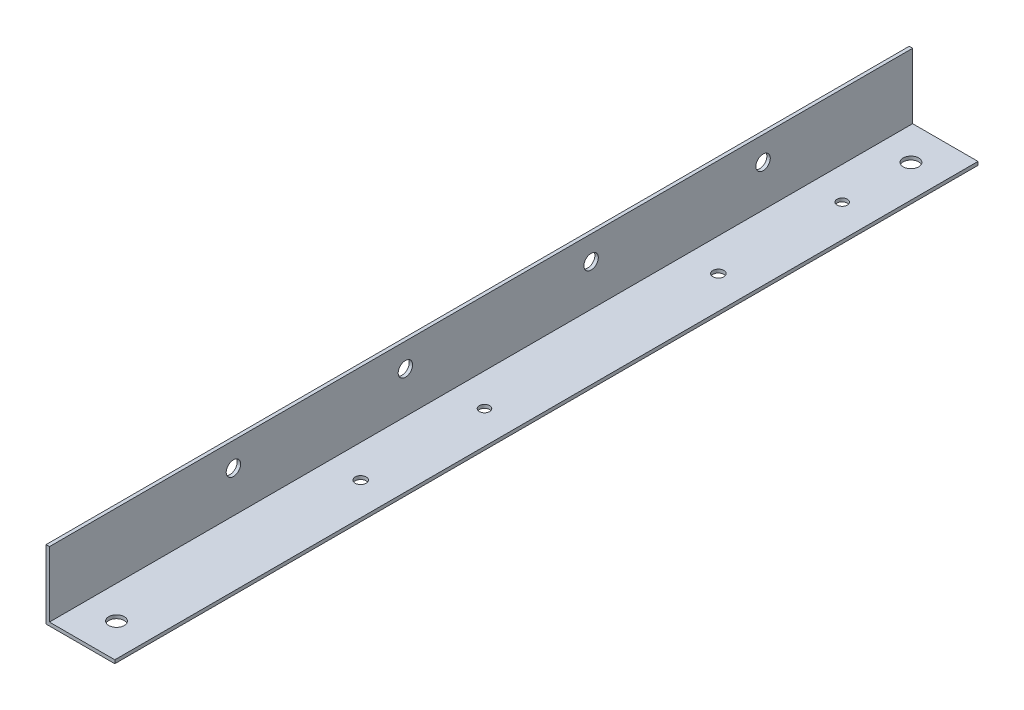
ISO-10303-21;
HEADER;
FILE_DESCRIPTION(('STEP AP214'),'2;1');
FILE_NAME('part.step','',(''),(''),'','','');
FILE_SCHEMA(('AUTOMOTIVE_DESIGN { 1 0 10303 214 1 1 1 1 }'));
ENDSEC;
DATA;
#1=APPLICATION_CONTEXT('core data for automotive mechanical design processes');
#2=APPLICATION_PROTOCOL_DEFINITION('international standard','automotive_design',2000,#1);
#3=PRODUCT_CONTEXT('',#1,'mechanical');
#4=PRODUCT('Part','Part','',(#3));
#5=PRODUCT_RELATED_PRODUCT_CATEGORY('part','',(#4));
#6=PRODUCT_DEFINITION_FORMATION('','',#4);
#7=PRODUCT_DEFINITION_CONTEXT('part definition',#1,'design');
#8=PRODUCT_DEFINITION('design','',#6,#7);
#9=PRODUCT_DEFINITION_SHAPE('','',#8);
#10=(LENGTH_UNIT() NAMED_UNIT(*) SI_UNIT(.MILLI.,.METRE.));
#11=(NAMED_UNIT(*) PLANE_ANGLE_UNIT() SI_UNIT($,.RADIAN.));
#12=(NAMED_UNIT(*) SI_UNIT($,.STERADIAN.) SOLID_ANGLE_UNIT());
#13=UNCERTAINTY_MEASURE_WITH_UNIT(LENGTH_MEASURE(1.E-05),#10,'distance_accuracy_value','');
#14=(GEOMETRIC_REPRESENTATION_CONTEXT(3) GLOBAL_UNCERTAINTY_ASSIGNED_CONTEXT((#13)) GLOBAL_UNIT_ASSIGNED_CONTEXT((#10,
#11,#12)) REPRESENTATION_CONTEXT('',''));
#15=CARTESIAN_POINT('',(0.,0.,0.));
#16=DIRECTION('',(0.,0.,1.));
#17=DIRECTION('',(1.,0.,0.));
#18=AXIS2_PLACEMENT_3D('',#15,#16,#17);
#19=CARTESIAN_POINT('',(20.,0.,251.));
#20=DIRECTION('',(0.,1.,0.));
#21=DIRECTION('',(-1.,0.,0.));
#22=AXIS2_PLACEMENT_3D('',#19,#20,#21);
#23=PLANE('',#22);
#24=CARTESIAN_POINT('',(10.5,0.,241.));
#25=DIRECTION('',(0.,1.,0.));
#26=DIRECTION('',(0.,0.,1.));
#27=AXIS2_PLACEMENT_3D('',#24,#25,#26);
#28=CIRCLE('',#27,2.25);
#29=CARTESIAN_POINT('',(10.5,0.,243.25));
#30=VERTEX_POINT('',#29);
#31=EDGE_CURVE('E171',#30,#30,#28,.T.);
#32=ORIENTED_EDGE('',*,*,#31,.T.);
#33=EDGE_LOOP('',(#32));
#34=FACE_BOUND('',#33,.T.);
#35=CARTESIAN_POINT('',(10.5,0.,10.));
#36=DIRECTION('',(0.,1.,0.));
#37=DIRECTION('',(0.,0.,1.));
#38=AXIS2_PLACEMENT_3D('',#35,#36,#37);
#39=CIRCLE('',#38,2.25);
#40=CARTESIAN_POINT('',(10.5,0.,12.25));
#41=VERTEX_POINT('',#40);
#42=EDGE_CURVE('E175',#41,#41,#39,.T.);
#43=ORIENTED_EDGE('',*,*,#42,.T.);
#44=EDGE_LOOP('',(#43));
#45=FACE_BOUND('',#44,.T.);
#46=CARTESIAN_POINT('',(10.5,0.,29.9999999999999));
#47=DIRECTION('',(0.,1.,0.));
#48=DIRECTION('',(0.,0.,1.));
#49=AXIS2_PLACEMENT_3D('',#46,#47,#48);
#50=CIRCLE('',#49,1.5);
#51=CARTESIAN_POINT('',(10.5,0.,31.4999999999999));
#52=VERTEX_POINT('',#51);
#53=EDGE_CURVE('E179',#52,#52,#50,.T.);
#54=ORIENTED_EDGE('',*,*,#53,.T.);
#55=EDGE_LOOP('',(#54));
#56=FACE_BOUND('',#55,.T.);
#57=CARTESIAN_POINT('',(10.5,0.,65.9999999999999));
#58=DIRECTION('',(0.,1.,0.));
#59=DIRECTION('',(0.,0.,1.));
#60=AXIS2_PLACEMENT_3D('',#57,#58,#59);
#61=CIRCLE('',#60,1.6);
#62=CARTESIAN_POINT('',(10.5,0.,67.5999999999999));
#63=VERTEX_POINT('',#62);
#64=EDGE_CURVE('E183',#63,#63,#61,.T.);
#65=ORIENTED_EDGE('',*,*,#64,.T.);
#66=EDGE_LOOP('',(#65));
#67=FACE_BOUND('',#66,.T.);
#68=CARTESIAN_POINT('',(10.5,0.,170.));
#69=DIRECTION('',(0.,1.,0.));
#70=DIRECTION('',(0.,0.,1.));
#71=AXIS2_PLACEMENT_3D('',#68,#69,#70);
#72=CIRCLE('',#71,1.59999999999999);
#73=CARTESIAN_POINT('',(10.5,0.,171.6));
#74=VERTEX_POINT('',#73);
#75=EDGE_CURVE('E187',#74,#74,#72,.T.);
#76=ORIENTED_EDGE('',*,*,#75,.T.);
#77=EDGE_LOOP('',(#76));
#78=FACE_BOUND('',#77,.T.);
#79=CARTESIAN_POINT('',(10.5,0.,134.));
#80=DIRECTION('',(0.,1.,0.));
#81=DIRECTION('',(0.,0.,1.));
#82=AXIS2_PLACEMENT_3D('',#79,#80,#81);
#83=CIRCLE('',#82,1.5);
#84=CARTESIAN_POINT('',(10.5,0.,135.5));
#85=VERTEX_POINT('',#84);
#86=EDGE_CURVE('E125',#85,#85,#83,.T.);
#87=ORIENTED_EDGE('',*,*,#86,.T.);
#88=EDGE_LOOP('',(#87));
#89=FACE_BOUND('',#88,.T.);
#90=DIRECTION('',(1.,0.,0.));
#91=VECTOR('',#90,1.);
#92=CARTESIAN_POINT('',(20.,0.,0.));
#93=LINE('',#92,#91);
#94=CARTESIAN_POINT('',(0.,0.,0.));
#95=VERTEX_POINT('',#94);
#96=CARTESIAN_POINT('',(20.,0.,0.));
#97=VERTEX_POINT('',#96);
#98=EDGE_CURVE('E121',#95,#97,#93,.T.);
#99=ORIENTED_EDGE('',*,*,#98,.T.);
#100=DIRECTION('',(0.,0.,-1.));
#101=VECTOR('',#100,1.);
#102=CARTESIAN_POINT('',(20.,0.,251.));
#103=LINE('',#102,#101);
#104=CARTESIAN_POINT('',(20.,0.,251.));
#105=VERTEX_POINT('',#104);
#106=EDGE_CURVE('E11',#105,#97,#103,.T.);
#107=ORIENTED_EDGE('',*,*,#106,.F.);
#108=DIRECTION('',(1.,0.,0.));
#109=VECTOR('',#108,1.);
#110=CARTESIAN_POINT('',(20.,0.,251.));
#111=LINE('',#110,#109);
#112=CARTESIAN_POINT('',(0.,0.,251.));
#113=VERTEX_POINT('',#112);
#114=EDGE_CURVE('E132',#113,#105,#111,.T.);
#115=ORIENTED_EDGE('',*,*,#114,.F.);
#116=DIRECTION('',(0.,0.,-1.));
#117=VECTOR('',#116,1.);
#118=CARTESIAN_POINT('',(0.,0.,251.));
#119=LINE('',#118,#117);
#120=EDGE_CURVE('E117',#113,#95,#119,.T.);
#121=ORIENTED_EDGE('',*,*,#120,.T.);
#122=EDGE_LOOP('',(#99,#107,#115,#121));
#123=FACE_BOUND('',#122,.T.);
#124=ADVANCED_FACE('F37',(#34,#45,#56,#67,#78,#89,#123),#23,.F.);
#125=CARTESIAN_POINT('',(20.,1.,251.));
#126=DIRECTION('',(-1.,0.,0.));
#127=DIRECTION('',(0.,0.,1.));
#128=AXIS2_PLACEMENT_3D('',#125,#126,#127);
#129=PLANE('',#128);
#130=DIRECTION('',(0.,1.,0.));
#131=VECTOR('',#130,1.);
#132=CARTESIAN_POINT('',(20.,1.,0.));
#133=LINE('',#132,#131);
#134=CARTESIAN_POINT('',(20.,1.,0.));
#135=VERTEX_POINT('',#134);
#136=EDGE_CURVE('E124',#97,#135,#133,.T.);
#137=ORIENTED_EDGE('',*,*,#136,.T.);
#138=DIRECTION('',(0.,0.,-1.));
#139=VECTOR('',#138,1.);
#140=CARTESIAN_POINT('',(20.,1.,251.));
#141=LINE('',#140,#139);
#142=CARTESIAN_POINT('',(20.,1.,251.));
#143=VERTEX_POINT('',#142);
#144=EDGE_CURVE('E45',#143,#135,#141,.T.);
#145=ORIENTED_EDGE('',*,*,#144,.F.);
#146=DIRECTION('',(0.,1.,0.));
#147=VECTOR('',#146,1.);
#148=CARTESIAN_POINT('',(20.,1.,251.));
#149=LINE('',#148,#147);
#150=EDGE_CURVE('E90',#105,#143,#149,.T.);
#151=ORIENTED_EDGE('',*,*,#150,.F.);
#152=ORIENTED_EDGE('',*,*,#106,.T.);
#153=EDGE_LOOP('',(#137,#145,#151,#152));
#154=FACE_BOUND('',#153,.T.);
#155=ADVANCED_FACE('F161',(#154),#129,.F.);
#156=CARTESIAN_POINT('',(1.,1.,251.));
#157=DIRECTION('',(0.,-1.,0.));
#158=DIRECTION('',(0.,0.,-1.));
#159=AXIS2_PLACEMENT_3D('',#156,#157,#158);
#160=PLANE('',#159);
#161=CARTESIAN_POINT('',(10.5,1.,241.));
#162=DIRECTION('',(0.,1.,0.));
#163=DIRECTION('',(0.,0.,1.));
#164=AXIS2_PLACEMENT_3D('',#161,#162,#163);
#165=CIRCLE('',#164,2.25);
#166=CARTESIAN_POINT('',(10.5,1.,243.25));
#167=VERTEX_POINT('',#166);
#168=EDGE_CURVE('E238',#167,#167,#165,.T.);
#169=ORIENTED_EDGE('',*,*,#168,.F.);
#170=EDGE_LOOP('',(#169));
#171=FACE_BOUND('',#170,.T.);
#172=CARTESIAN_POINT('',(10.5,1.,10.));
#173=DIRECTION('',(0.,1.,0.));
#174=DIRECTION('',(0.,0.,1.));
#175=AXIS2_PLACEMENT_3D('',#172,#173,#174);
#176=CIRCLE('',#175,2.25);
#177=CARTESIAN_POINT('',(10.5,1.,12.25));
#178=VERTEX_POINT('',#177);
#179=EDGE_CURVE('E234',#178,#178,#176,.T.);
#180=ORIENTED_EDGE('',*,*,#179,.F.);
#181=EDGE_LOOP('',(#180));
#182=FACE_BOUND('',#181,.T.);
#183=CARTESIAN_POINT('',(10.5,1.,29.9999999999999));
#184=DIRECTION('',(0.,1.,0.));
#185=DIRECTION('',(0.,0.,1.));
#186=AXIS2_PLACEMENT_3D('',#183,#184,#185);
#187=CIRCLE('',#186,1.5);
#188=CARTESIAN_POINT('',(10.5,1.,31.4999999999999));
#189=VERTEX_POINT('',#188);
#190=EDGE_CURVE('E206',#189,#189,#187,.T.);
#191=ORIENTED_EDGE('',*,*,#190,.F.);
#192=EDGE_LOOP('',(#191));
#193=FACE_BOUND('',#192,.T.);
#194=CARTESIAN_POINT('',(10.5,1.,65.9999999999999));
#195=DIRECTION('',(0.,1.,0.));
#196=DIRECTION('',(0.,0.,1.));
#197=AXIS2_PLACEMENT_3D('',#194,#195,#196);
#198=CIRCLE('',#197,1.6);
#199=CARTESIAN_POINT('',(10.5,1.,67.5999999999999));
#200=VERTEX_POINT('',#199);
#201=EDGE_CURVE('E202',#200,#200,#198,.T.);
#202=ORIENTED_EDGE('',*,*,#201,.F.);
#203=EDGE_LOOP('',(#202));
#204=FACE_BOUND('',#203,.T.);
#205=CARTESIAN_POINT('',(10.5,1.,170.));
#206=DIRECTION('',(0.,1.,0.));
#207=DIRECTION('',(0.,0.,1.));
#208=AXIS2_PLACEMENT_3D('',#205,#206,#207);
#209=CIRCLE('',#208,1.59999999999999);
#210=CARTESIAN_POINT('',(10.5,1.,171.6));
#211=VERTEX_POINT('',#210);
#212=EDGE_CURVE('E196',#211,#211,#209,.T.);
#213=ORIENTED_EDGE('',*,*,#212,.F.);
#214=EDGE_LOOP('',(#213));
#215=FACE_BOUND('',#214,.T.);
#216=CARTESIAN_POINT('',(10.5,1.,134.));
#217=DIRECTION('',(0.,1.,0.));
#218=DIRECTION('',(0.,0.,1.));
#219=AXIS2_PLACEMENT_3D('',#216,#217,#218);
#220=CIRCLE('',#219,1.5);
#221=CARTESIAN_POINT('',(10.5,1.,135.5));
#222=VERTEX_POINT('',#221);
#223=EDGE_CURVE('E191',#222,#222,#220,.T.);
#224=ORIENTED_EDGE('',*,*,#223,.F.);
#225=EDGE_LOOP('',(#224));
#226=FACE_BOUND('',#225,.T.);
#227=DIRECTION('',(-1.,0.,0.));
#228=VECTOR('',#227,1.);
#229=CARTESIAN_POINT('',(1.,1.,0.));
#230=LINE('',#229,#228);
#231=CARTESIAN_POINT('',(1.,1.,0.));
#232=VERTEX_POINT('',#231);
#233=EDGE_CURVE('E127',#135,#232,#230,.T.);
#234=ORIENTED_EDGE('',*,*,#233,.T.);
#235=DIRECTION('',(0.,0.,-1.));
#236=VECTOR('',#235,1.);
#237=CARTESIAN_POINT('',(1.,1.,251.));
#238=LINE('',#237,#236);
#239=CARTESIAN_POINT('',(1.,1.,251.));
#240=VERTEX_POINT('',#239);
#241=EDGE_CURVE('E112',#240,#232,#238,.T.);
#242=ORIENTED_EDGE('',*,*,#241,.F.);
#243=DIRECTION('',(-1.,0.,0.));
#244=VECTOR('',#243,1.);
#245=CARTESIAN_POINT('',(1.,1.,251.));
#246=LINE('',#245,#244);
#247=EDGE_CURVE('E103',#143,#240,#246,.T.);
#248=ORIENTED_EDGE('',*,*,#247,.F.);
#249=ORIENTED_EDGE('',*,*,#144,.T.);
#250=EDGE_LOOP('',(#234,#242,#248,#249));
#251=FACE_BOUND('',#250,.T.);
#252=ADVANCED_FACE('F138',(#171,#182,#193,#204,#215,#226,#251),#160,.F.);
#253=CARTESIAN_POINT('',(1.,20.,251.));
#254=DIRECTION('',(-1.,0.,0.));
#255=DIRECTION('',(0.,-1.,0.));
#256=AXIS2_PLACEMENT_3D('',#253,#254,#255);
#257=PLANE('',#256);
#258=CARTESIAN_POINT('',(1.,13.,197.5));
#259=DIRECTION('',(-1.,0.,0.));
#260=DIRECTION('',(0.,-1.,0.));
#261=AXIS2_PLACEMENT_3D('',#258,#259,#260);
#262=CIRCLE('',#261,2.09999999999999);
#263=CARTESIAN_POINT('',(1.,10.9,197.5));
#264=VERTEX_POINT('',#263);
#265=EDGE_CURVE('E228',#264,#264,#262,.T.);
#266=ORIENTED_EDGE('',*,*,#265,.T.);
#267=EDGE_LOOP('',(#266));
#268=FACE_BOUND('',#267,.T.);
#269=CARTESIAN_POINT('',(1.,13.,147.5));
#270=DIRECTION('',(-1.,0.,0.));
#271=DIRECTION('',(0.,-1.,0.));
#272=AXIS2_PLACEMENT_3D('',#269,#270,#271);
#273=CIRCLE('',#272,2.09999999999999);
#274=CARTESIAN_POINT('',(1.,10.9,147.5));
#275=VERTEX_POINT('',#274);
#276=EDGE_CURVE('E222',#275,#275,#273,.T.);
#277=ORIENTED_EDGE('',*,*,#276,.T.);
#278=EDGE_LOOP('',(#277));
#279=FACE_BOUND('',#278,.T.);
#280=CARTESIAN_POINT('',(1.,13.,93.4999999999999));
#281=DIRECTION('',(-1.,0.,0.));
#282=DIRECTION('',(0.,-1.,0.));
#283=AXIS2_PLACEMENT_3D('',#280,#281,#282);
#284=CIRCLE('',#283,2.1);
#285=CARTESIAN_POINT('',(1.,10.9,93.4999999999999));
#286=VERTEX_POINT('',#285);
#287=EDGE_CURVE('E216',#286,#286,#284,.T.);
#288=ORIENTED_EDGE('',*,*,#287,.T.);
#289=EDGE_LOOP('',(#288));
#290=FACE_BOUND('',#289,.T.);
#291=CARTESIAN_POINT('',(1.,13.,43.4999999999999));
#292=DIRECTION('',(-1.,0.,0.));
#293=DIRECTION('',(0.,-1.,0.));
#294=AXIS2_PLACEMENT_3D('',#291,#292,#293);
#295=CIRCLE('',#294,2.1);
#296=CARTESIAN_POINT('',(1.,10.9,43.4999999999999));
#297=VERTEX_POINT('',#296);
#298=EDGE_CURVE('E209',#297,#297,#295,.T.);
#299=ORIENTED_EDGE('',*,*,#298,.T.);
#300=EDGE_LOOP('',(#299));
#301=FACE_BOUND('',#300,.T.);
#302=DIRECTION('',(0.,1.,0.));
#303=VECTOR('',#302,1.);
#304=CARTESIAN_POINT('',(1.,20.,0.));
#305=LINE('',#304,#303);
#306=CARTESIAN_POINT('',(1.,20.,0.));
#307=VERTEX_POINT('',#306);
#308=EDGE_CURVE('E111',#232,#307,#305,.T.);
#309=ORIENTED_EDGE('',*,*,#308,.T.);
#310=DIRECTION('',(0.,0.,-1.));
#311=VECTOR('',#310,1.);
#312=CARTESIAN_POINT('',(1.,20.,251.));
#313=LINE('',#312,#311);
#314=CARTESIAN_POINT('',(1.,20.,251.));
#315=VERTEX_POINT('',#314);
#316=EDGE_CURVE('E108',#315,#307,#313,.T.);
#317=ORIENTED_EDGE('',*,*,#316,.F.);
#318=DIRECTION('',(0.,1.,0.));
#319=VECTOR('',#318,1.);
#320=CARTESIAN_POINT('',(1.,20.,251.));
#321=LINE('',#320,#319);
#322=EDGE_CURVE('E97',#240,#315,#321,.T.);
#323=ORIENTED_EDGE('',*,*,#322,.F.);
#324=ORIENTED_EDGE('',*,*,#241,.T.);
#325=EDGE_LOOP('',(#309,#317,#323,#324));
#326=FACE_BOUND('',#325,.T.);
#327=ADVANCED_FACE('F109',(#268,#279,#290,#301,#326),#257,.F.);
#328=CARTESIAN_POINT('',(0.,20.,251.));
#329=DIRECTION('',(0.,-1.,0.));
#330=DIRECTION('',(0.,0.,-1.));
#331=AXIS2_PLACEMENT_3D('',#328,#329,#330);
#332=PLANE('',#331);
#333=DIRECTION('',(-1.,0.,0.));
#334=VECTOR('',#333,1.);
#335=CARTESIAN_POINT('',(0.,20.,0.));
#336=LINE('',#335,#334);
#337=CARTESIAN_POINT('',(0.,20.,0.));
#338=VERTEX_POINT('',#337);
#339=EDGE_CURVE('E76',#307,#338,#336,.T.);
#340=ORIENTED_EDGE('',*,*,#339,.T.);
#341=DIRECTION('',(0.,0.,-1.));
#342=VECTOR('',#341,1.);
#343=CARTESIAN_POINT('',(0.,20.,251.));
#344=LINE('',#343,#342);
#345=CARTESIAN_POINT('',(0.,20.,251.));
#346=VERTEX_POINT('',#345);
#347=EDGE_CURVE('E113',#346,#338,#344,.T.);
#348=ORIENTED_EDGE('',*,*,#347,.F.);
#349=DIRECTION('',(-1.,0.,0.));
#350=VECTOR('',#349,1.);
#351=CARTESIAN_POINT('',(0.,20.,251.));
#352=LINE('',#351,#350);
#353=EDGE_CURVE('E101',#315,#346,#352,.T.);
#354=ORIENTED_EDGE('',*,*,#353,.F.);
#355=ORIENTED_EDGE('',*,*,#316,.T.);
#356=EDGE_LOOP('',(#340,#348,#354,#355));
#357=FACE_BOUND('',#356,.T.);
#358=ADVANCED_FACE('F115',(#357),#332,.F.);
#359=CARTESIAN_POINT('',(0.,0.,251.));
#360=DIRECTION('',(1.,0.,0.));
#361=DIRECTION('',(0.,0.,-1.));
#362=AXIS2_PLACEMENT_3D('',#359,#360,#361);
#363=PLANE('',#362);
#364=CARTESIAN_POINT('',(0.,13.,197.5));
#365=DIRECTION('',(-1.,0.,0.));
#366=DIRECTION('',(0.,0.,1.));
#367=AXIS2_PLACEMENT_3D('',#364,#365,#366);
#368=CIRCLE('',#367,2.09999999999999);
#369=CARTESIAN_POINT('',(0.,13.,199.6));
#370=VERTEX_POINT('',#369);
#371=EDGE_CURVE('E231',#370,#370,#368,.T.);
#372=ORIENTED_EDGE('',*,*,#371,.F.);
#373=EDGE_LOOP('',(#372));
#374=FACE_BOUND('',#373,.T.);
#375=CARTESIAN_POINT('',(0.,13.,147.5));
#376=DIRECTION('',(-1.,0.,0.));
#377=DIRECTION('',(0.,0.,1.));
#378=AXIS2_PLACEMENT_3D('',#375,#376,#377);
#379=CIRCLE('',#378,2.09999999999999);
#380=CARTESIAN_POINT('',(0.,13.,149.6));
#381=VERTEX_POINT('',#380);
#382=EDGE_CURVE('E225',#381,#381,#379,.T.);
#383=ORIENTED_EDGE('',*,*,#382,.F.);
#384=EDGE_LOOP('',(#383));
#385=FACE_BOUND('',#384,.T.);
#386=CARTESIAN_POINT('',(0.,13.,93.4999999999999));
#387=DIRECTION('',(-1.,0.,0.));
#388=DIRECTION('',(0.,0.,1.));
#389=AXIS2_PLACEMENT_3D('',#386,#387,#388);
#390=CIRCLE('',#389,2.1);
#391=CARTESIAN_POINT('',(0.,13.,95.5999999999999));
#392=VERTEX_POINT('',#391);
#393=EDGE_CURVE('E219',#392,#392,#390,.T.);
#394=ORIENTED_EDGE('',*,*,#393,.F.);
#395=EDGE_LOOP('',(#394));
#396=FACE_BOUND('',#395,.T.);
#397=CARTESIAN_POINT('',(0.,13.,43.4999999999999));
#398=DIRECTION('',(-1.,0.,0.));
#399=DIRECTION('',(0.,0.,1.));
#400=AXIS2_PLACEMENT_3D('',#397,#398,#399);
#401=CIRCLE('',#400,2.1);
#402=CARTESIAN_POINT('',(0.,13.,45.5999999999999));
#403=VERTEX_POINT('',#402);
#404=EDGE_CURVE('E213',#403,#403,#401,.T.);
#405=ORIENTED_EDGE('',*,*,#404,.F.);
#406=EDGE_LOOP('',(#405));
#407=FACE_BOUND('',#406,.T.);
#408=DIRECTION('',(0.,-1.,0.));
#409=VECTOR('',#408,1.);
#410=CARTESIAN_POINT('',(0.,0.,0.));
#411=LINE('',#410,#409);
#412=EDGE_CURVE('E82',#338,#95,#411,.T.);
#413=ORIENTED_EDGE('',*,*,#412,.T.);
#414=ORIENTED_EDGE('',*,*,#120,.F.);
#415=DIRECTION('',(0.,-1.,0.));
#416=VECTOR('',#415,1.);
#417=CARTESIAN_POINT('',(0.,0.,251.));
#418=LINE('',#417,#416);
#419=EDGE_CURVE('E53',#346,#113,#418,.T.);
#420=ORIENTED_EDGE('',*,*,#419,.F.);
#421=ORIENTED_EDGE('',*,*,#347,.T.);
#422=EDGE_LOOP('',(#413,#414,#420,#421));
#423=FACE_BOUND('',#422,.T.);
#424=ADVANCED_FACE('F145',(#374,#385,#396,#407,#423),#363,.F.);
#425=CARTESIAN_POINT('',(0.,0.,251.));
#426=DIRECTION('',(0.,0.,-1.));
#427=DIRECTION('',(-1.,0.,0.));
#428=AXIS2_PLACEMENT_3D('',#425,#426,#427);
#429=PLANE('',#428);
#430=ORIENTED_EDGE('',*,*,#114,.T.);
#431=ORIENTED_EDGE('',*,*,#150,.T.);
#432=ORIENTED_EDGE('',*,*,#247,.T.);
#433=ORIENTED_EDGE('',*,*,#322,.T.);
#434=ORIENTED_EDGE('',*,*,#353,.T.);
#435=ORIENTED_EDGE('',*,*,#419,.T.);
#436=EDGE_LOOP('',(#430,#431,#432,#433,#434,#435));
#437=FACE_BOUND('',#436,.T.);
#438=ADVANCED_FACE('F99',(#437),#429,.F.);
#439=CARTESIAN_POINT('',(0.,0.,0.));
#440=DIRECTION('',(0.,0.,-1.));
#441=DIRECTION('',(-1.,0.,0.));
#442=AXIS2_PLACEMENT_3D('',#439,#440,#441);
#443=PLANE('',#442);
#444=ORIENTED_EDGE('',*,*,#98,.F.);
#445=ORIENTED_EDGE('',*,*,#412,.F.);
#446=ORIENTED_EDGE('',*,*,#339,.F.);
#447=ORIENTED_EDGE('',*,*,#308,.F.);
#448=ORIENTED_EDGE('',*,*,#233,.F.);
#449=ORIENTED_EDGE('',*,*,#136,.F.);
#450=EDGE_LOOP('',(#444,#445,#446,#447,#448,#449));
#451=FACE_BOUND('',#450,.T.);
#452=ADVANCED_FACE('F141',(#451),#443,.T.);
#453=CARTESIAN_POINT('',(10.5,0.,134.));
#454=DIRECTION('',(0.,1.,0.));
#455=DIRECTION('',(0.,0.,1.));
#456=AXIS2_PLACEMENT_3D('',#453,#454,#455);
#457=CYLINDRICAL_SURFACE('',#456,1.5);
#458=ORIENTED_EDGE('',*,*,#86,.F.);
#459=EDGE_LOOP('',(#458));
#460=FACE_BOUND('',#459,.T.);
#461=ORIENTED_EDGE('',*,*,#223,.T.);
#462=EDGE_LOOP('',(#461));
#463=FACE_BOUND('',#462,.T.);
#464=ADVANCED_FACE('F257',(#460,#463),#457,.F.);
#465=CARTESIAN_POINT('',(10.5,0.,170.));
#466=DIRECTION('',(0.,1.,0.));
#467=DIRECTION('',(0.,0.,1.));
#468=AXIS2_PLACEMENT_3D('',#465,#466,#467);
#469=CYLINDRICAL_SURFACE('',#468,1.59999999999999);
#470=ORIENTED_EDGE('',*,*,#75,.F.);
#471=EDGE_LOOP('',(#470));
#472=FACE_BOUND('',#471,.T.);
#473=ORIENTED_EDGE('',*,*,#212,.T.);
#474=EDGE_LOOP('',(#473));
#475=FACE_BOUND('',#474,.T.);
#476=ADVANCED_FACE('F259',(#472,#475),#469,.F.);
#477=CARTESIAN_POINT('',(10.5,0.,65.9999999999999));
#478=DIRECTION('',(0.,1.,0.));
#479=DIRECTION('',(0.,0.,1.));
#480=AXIS2_PLACEMENT_3D('',#477,#478,#479);
#481=CYLINDRICAL_SURFACE('',#480,1.6);
#482=ORIENTED_EDGE('',*,*,#64,.F.);
#483=EDGE_LOOP('',(#482));
#484=FACE_BOUND('',#483,.T.);
#485=ORIENTED_EDGE('',*,*,#201,.T.);
#486=EDGE_LOOP('',(#485));
#487=FACE_BOUND('',#486,.T.);
#488=ADVANCED_FACE('F265',(#484,#487),#481,.F.);
#489=CARTESIAN_POINT('',(10.5,0.,29.9999999999999));
#490=DIRECTION('',(0.,1.,0.));
#491=DIRECTION('',(0.,0.,1.));
#492=AXIS2_PLACEMENT_3D('',#489,#490,#491);
#493=CYLINDRICAL_SURFACE('',#492,1.5);
#494=ORIENTED_EDGE('',*,*,#53,.F.);
#495=EDGE_LOOP('',(#494));
#496=FACE_BOUND('',#495,.T.);
#497=ORIENTED_EDGE('',*,*,#190,.T.);
#498=EDGE_LOOP('',(#497));
#499=FACE_BOUND('',#498,.T.);
#500=ADVANCED_FACE('F271',(#496,#499),#493,.F.);
#501=CARTESIAN_POINT('',(20.,13.,43.4999999999999));
#502=DIRECTION('',(-1.,0.,0.));
#503=DIRECTION('',(0.,0.,1.));
#504=AXIS2_PLACEMENT_3D('',#501,#502,#503);
#505=CYLINDRICAL_SURFACE('',#504,2.1);
#506=ORIENTED_EDGE('',*,*,#404,.T.);
#507=EDGE_LOOP('',(#506));
#508=FACE_BOUND('',#507,.T.);
#509=ORIENTED_EDGE('',*,*,#298,.F.);
#510=EDGE_LOOP('',(#509));
#511=FACE_BOUND('',#510,.T.);
#512=ADVANCED_FACE('F275',(#508,#511),#505,.F.);
#513=CARTESIAN_POINT('',(20.,13.,93.4999999999999));
#514=DIRECTION('',(-1.,0.,0.));
#515=DIRECTION('',(0.,0.,1.));
#516=AXIS2_PLACEMENT_3D('',#513,#514,#515);
#517=CYLINDRICAL_SURFACE('',#516,2.1);
#518=ORIENTED_EDGE('',*,*,#393,.T.);
#519=EDGE_LOOP('',(#518));
#520=FACE_BOUND('',#519,.T.);
#521=ORIENTED_EDGE('',*,*,#287,.F.);
#522=EDGE_LOOP('',(#521));
#523=FACE_BOUND('',#522,.T.);
#524=ADVANCED_FACE('F279',(#520,#523),#517,.F.);
#525=CARTESIAN_POINT('',(20.,13.,147.5));
#526=DIRECTION('',(-1.,0.,0.));
#527=DIRECTION('',(0.,0.,1.));
#528=AXIS2_PLACEMENT_3D('',#525,#526,#527);
#529=CYLINDRICAL_SURFACE('',#528,2.09999999999999);
#530=ORIENTED_EDGE('',*,*,#382,.T.);
#531=EDGE_LOOP('',(#530));
#532=FACE_BOUND('',#531,.T.);
#533=ORIENTED_EDGE('',*,*,#276,.F.);
#534=EDGE_LOOP('',(#533));
#535=FACE_BOUND('',#534,.T.);
#536=ADVANCED_FACE('F283',(#532,#535),#529,.F.);
#537=CARTESIAN_POINT('',(20.,13.,197.5));
#538=DIRECTION('',(-1.,0.,0.));
#539=DIRECTION('',(0.,0.,1.));
#540=AXIS2_PLACEMENT_3D('',#537,#538,#539);
#541=CYLINDRICAL_SURFACE('',#540,2.09999999999999);
#542=ORIENTED_EDGE('',*,*,#371,.T.);
#543=EDGE_LOOP('',(#542));
#544=FACE_BOUND('',#543,.T.);
#545=ORIENTED_EDGE('',*,*,#265,.F.);
#546=EDGE_LOOP('',(#545));
#547=FACE_BOUND('',#546,.T.);
#548=ADVANCED_FACE('F287',(#544,#547),#541,.F.);
#549=CARTESIAN_POINT('',(10.5,0.,10.));
#550=DIRECTION('',(0.,1.,0.));
#551=DIRECTION('',(0.,0.,1.));
#552=AXIS2_PLACEMENT_3D('',#549,#550,#551);
#553=CYLINDRICAL_SURFACE('',#552,2.25);
#554=ORIENTED_EDGE('',*,*,#42,.F.);
#555=EDGE_LOOP('',(#554));
#556=FACE_BOUND('',#555,.T.);
#557=ORIENTED_EDGE('',*,*,#179,.T.);
#558=EDGE_LOOP('',(#557));
#559=FACE_BOUND('',#558,.T.);
#560=ADVANCED_FACE('F291',(#556,#559),#553,.F.);
#561=CARTESIAN_POINT('',(10.5,0.,241.));
#562=DIRECTION('',(0.,1.,0.));
#563=DIRECTION('',(0.,0.,1.));
#564=AXIS2_PLACEMENT_3D('',#561,#562,#563);
#565=CYLINDRICAL_SURFACE('',#564,2.25);
#566=ORIENTED_EDGE('',*,*,#31,.F.);
#567=EDGE_LOOP('',(#566));
#568=FACE_BOUND('',#567,.T.);
#569=ORIENTED_EDGE('',*,*,#168,.T.);
#570=EDGE_LOOP('',(#569));
#571=FACE_BOUND('',#570,.T.);
#572=ADVANCED_FACE('F243',(#568,#571),#565,.F.);
#573=CLOSED_SHELL('',(#124,#155,#252,#327,#358,#424,#438,#452,#464,#476,#488,#500,#512,#524,
#536,#548,#560,#572));
#574=MANIFOLD_SOLID_BREP('B2',#573);
#575=ADVANCED_BREP_SHAPE_REPRESENTATION('',(#18,#574),#14);
#576=SHAPE_DEFINITION_REPRESENTATION(#9,#575);
ENDSEC;
END-ISO-10303-21;
